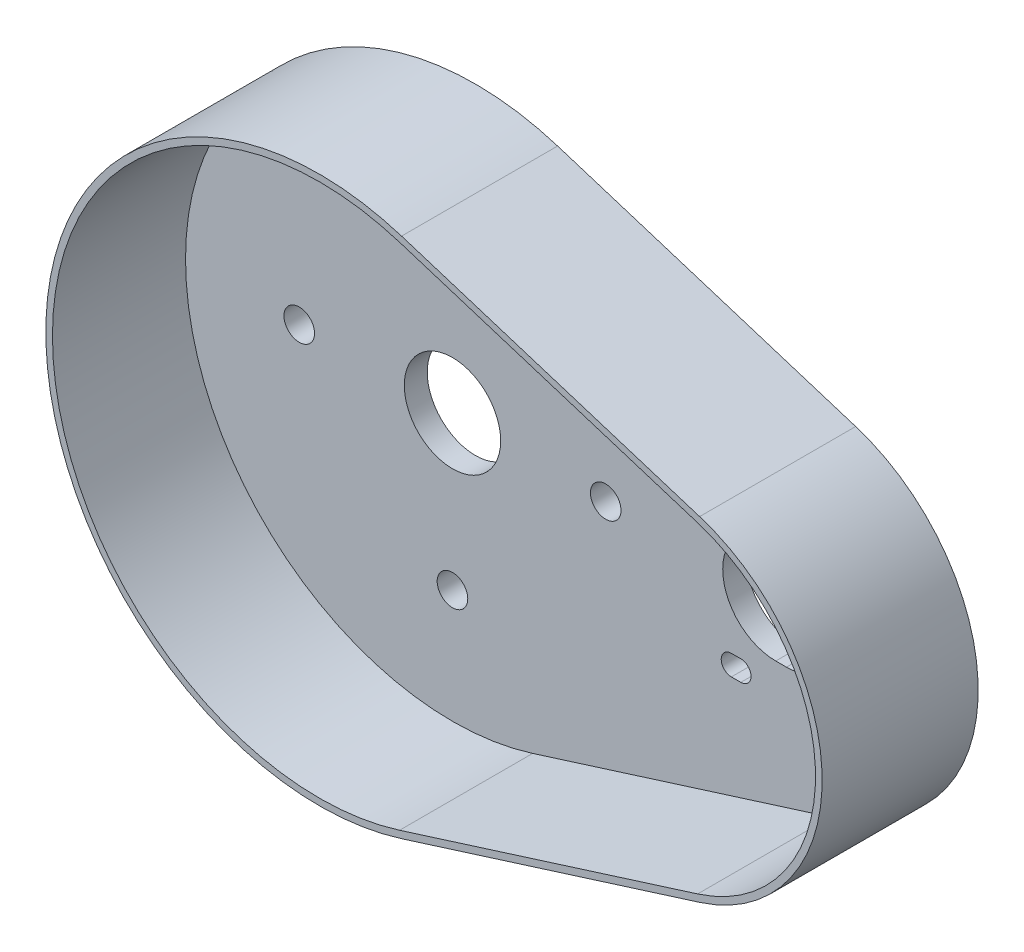
ISO-10303-21;
HEADER;
FILE_DESCRIPTION(('STEP AP214'),'2;1');
FILE_NAME('part.step','',(''),(''),'','','');
FILE_SCHEMA(('AUTOMOTIVE_DESIGN { 1 0 10303 214 1 1 1 1 }'));
ENDSEC;
DATA;
#1=APPLICATION_CONTEXT('core data for automotive mechanical design processes');
#2=APPLICATION_PROTOCOL_DEFINITION('international standard','automotive_design',2000,#1);
#3=PRODUCT_CONTEXT('',#1,'mechanical');
#4=PRODUCT('Part','Part','',(#3));
#5=PRODUCT_RELATED_PRODUCT_CATEGORY('part','',(#4));
#6=PRODUCT_DEFINITION_FORMATION('','',#4);
#7=PRODUCT_DEFINITION_CONTEXT('part definition',#1,'design');
#8=PRODUCT_DEFINITION('design','',#6,#7);
#9=PRODUCT_DEFINITION_SHAPE('','',#8);
#10=(LENGTH_UNIT() NAMED_UNIT(*) SI_UNIT(.MILLI.,.METRE.));
#11=(NAMED_UNIT(*) PLANE_ANGLE_UNIT() SI_UNIT($,.RADIAN.));
#12=(NAMED_UNIT(*) SI_UNIT($,.STERADIAN.) SOLID_ANGLE_UNIT());
#13=UNCERTAINTY_MEASURE_WITH_UNIT(LENGTH_MEASURE(1.E-05),#10,'distance_accuracy_value','');
#14=(GEOMETRIC_REPRESENTATION_CONTEXT(3) GLOBAL_UNCERTAINTY_ASSIGNED_CONTEXT((#13)) GLOBAL_UNIT_ASSIGNED_CONTEXT((#10,
#11,#12)) REPRESENTATION_CONTEXT('',''));
#15=CARTESIAN_POINT('',(0.,0.,0.));
#16=DIRECTION('',(0.,0.,1.));
#17=DIRECTION('',(1.,0.,0.));
#18=AXIS2_PLACEMENT_3D('',#15,#16,#17);
#19=CARTESIAN_POINT('',(0.,-13.4500000000001,30.6));
#20=DIRECTION('',(0.,1.,0.));
#21=DIRECTION('',(-1.,0.,0.));
#22=AXIS2_PLACEMENT_3D('',#19,#20,#21);
#23=PLANE('',#22);
#24=DIRECTION('',(1.,0.,0.));
#25=VECTOR('',#24,1.);
#26=CARTESIAN_POINT('',(0.,-13.4500000000001,4.5));
#27=LINE('',#26,#25);
#28=CARTESIAN_POINT('',(54.7010949780275,-13.45,4.5));
#29=VERTEX_POINT('',#28);
#30=CARTESIAN_POINT('',(56.5510949780275,-13.45,4.5));
#31=VERTEX_POINT('',#30);
#32=EDGE_CURVE('E270',#29,#31,#27,.T.);
#33=ORIENTED_EDGE('',*,*,#32,.F.);
#34=DIRECTION('',(0.,0.,-1.));
#35=VECTOR('',#34,1.);
#36=CARTESIAN_POINT('',(54.7010949780275,-13.45,30.6));
#37=LINE('',#36,#35);
#38=CARTESIAN_POINT('',(54.7010949780275,-13.45,0.));
#39=VERTEX_POINT('',#38);
#40=EDGE_CURVE('E422',#29,#39,#37,.T.);
#41=ORIENTED_EDGE('',*,*,#40,.T.);
#42=DIRECTION('',(1.,0.,0.));
#43=VECTOR('',#42,1.);
#44=CARTESIAN_POINT('',(0.,-13.4500000000001,0.));
#45=LINE('',#44,#43);
#46=CARTESIAN_POINT('',(56.5510949780275,-13.45,0.));
#47=VERTEX_POINT('',#46);
#48=EDGE_CURVE('E411',#39,#47,#45,.T.);
#49=ORIENTED_EDGE('',*,*,#48,.T.);
#50=DIRECTION('',(0.,0.,-1.));
#51=VECTOR('',#50,1.);
#52=CARTESIAN_POINT('',(56.5510949780275,-13.45,30.6));
#53=LINE('',#52,#51);
#54=EDGE_CURVE('E46',#31,#47,#53,.T.);
#55=ORIENTED_EDGE('',*,*,#54,.F.);
#56=EDGE_LOOP('',(#33,#41,#49,#55));
#57=FACE_BOUND('',#56,.T.);
#58=ADVANCED_FACE('F38',(#57),#23,.F.);
#59=CARTESIAN_POINT('',(56.5510949780275,-15.45,30.6));
#60=DIRECTION('',(0.,0.,-1.));
#61=DIRECTION('',(-1.,0.,0.));
#62=AXIS2_PLACEMENT_3D('',#59,#60,#61);
#63=CYLINDRICAL_SURFACE('',#62,2.);
#64=CARTESIAN_POINT('',(56.5510949780275,-15.45,4.5));
#65=DIRECTION('',(0.,0.,1.));
#66=DIRECTION('',(1.,0.,0.));
#67=AXIS2_PLACEMENT_3D('',#64,#65,#66);
#68=CIRCLE('',#67,2.);
#69=CARTESIAN_POINT('',(56.5510949780275,-17.45,4.5));
#70=VERTEX_POINT('',#69);
#71=EDGE_CURVE('E268',#31,#70,#68,.F.);
#72=ORIENTED_EDGE('',*,*,#71,.F.);
#73=ORIENTED_EDGE('',*,*,#54,.T.);
#74=CARTESIAN_POINT('',(56.5510949780275,-15.45,0.));
#75=DIRECTION('',(0.,0.,1.));
#76=DIRECTION('',(1.,0.,0.));
#77=AXIS2_PLACEMENT_3D('',#74,#75,#76);
#78=CIRCLE('',#77,2.);
#79=CARTESIAN_POINT('',(56.5510949780275,-17.45,0.));
#80=VERTEX_POINT('',#79);
#81=EDGE_CURVE('E414',#47,#80,#78,.F.);
#82=ORIENTED_EDGE('',*,*,#81,.T.);
#83=DIRECTION('',(0.,0.,-1.));
#84=VECTOR('',#83,1.);
#85=CARTESIAN_POINT('',(56.5510949780275,-17.45,30.6));
#86=LINE('',#85,#84);
#87=EDGE_CURVE('E427',#70,#80,#86,.T.);
#88=ORIENTED_EDGE('',*,*,#87,.F.);
#89=EDGE_LOOP('',(#72,#73,#82,#88));
#90=FACE_BOUND('',#89,.T.);
#91=ADVANCED_FACE('F500',(#90),#63,.F.);
#92=CARTESIAN_POINT('',(0.,-17.4499999999999,30.6));
#93=DIRECTION('',(0.,1.,0.));
#94=DIRECTION('',(-1.,0.,0.));
#95=AXIS2_PLACEMENT_3D('',#92,#93,#94);
#96=PLANE('',#95);
#97=DIRECTION('',(0.,0.,-1.));
#98=VECTOR('',#97,1.);
#99=CARTESIAN_POINT('',(54.7010949780275,-17.45,30.6));
#100=LINE('',#99,#98);
#101=CARTESIAN_POINT('',(54.7010949780275,-17.45,4.5));
#102=VERTEX_POINT('',#101);
#103=CARTESIAN_POINT('',(54.7010949780275,-17.45,0.));
#104=VERTEX_POINT('',#103);
#105=EDGE_CURVE('E424',#102,#104,#100,.T.);
#106=ORIENTED_EDGE('',*,*,#105,.F.);
#107=DIRECTION('',(1.,0.,0.));
#108=VECTOR('',#107,1.);
#109=CARTESIAN_POINT('',(0.,-17.4499999999999,4.5));
#110=LINE('',#109,#108);
#111=EDGE_CURVE('E262',#102,#70,#110,.T.);
#112=ORIENTED_EDGE('',*,*,#111,.T.);
#113=ORIENTED_EDGE('',*,*,#87,.T.);
#114=DIRECTION('',(1.,0.,0.));
#115=VECTOR('',#114,1.);
#116=CARTESIAN_POINT('',(0.,-17.4499999999999,0.));
#117=LINE('',#116,#115);
#118=EDGE_CURVE('E417',#104,#80,#117,.T.);
#119=ORIENTED_EDGE('',*,*,#118,.F.);
#120=EDGE_LOOP('',(#106,#112,#113,#119));
#121=FACE_BOUND('',#120,.T.);
#122=ADVANCED_FACE('F506',(#121),#96,.T.);
#123=CARTESIAN_POINT('',(0.,-13.45,30.6));
#124=DIRECTION('',(0.,1.,0.));
#125=DIRECTION('',(0.,0.,1.));
#126=AXIS2_PLACEMENT_3D('',#123,#124,#125);
#127=PLANE('',#126);
#128=DIRECTION('',(1.,0.,0.));
#129=VECTOR('',#128,1.);
#130=CARTESIAN_POINT('',(0.,-13.45,4.5));
#131=LINE('',#130,#129);
#132=CARTESIAN_POINT('',(85.7510949780275,-13.45,4.5));
#133=VERTEX_POINT('',#132);
#134=CARTESIAN_POINT('',(87.6010949780275,-13.45,4.5));
#135=VERTEX_POINT('',#134);
#136=EDGE_CURVE('E323',#133,#135,#131,.T.);
#137=ORIENTED_EDGE('',*,*,#136,.F.);
#138=DIRECTION('',(0.,0.,-1.));
#139=VECTOR('',#138,1.);
#140=CARTESIAN_POINT('',(85.7510949780275,-13.45,30.6));
#141=LINE('',#140,#139);
#142=CARTESIAN_POINT('',(85.7510949780275,-13.45,0.));
#143=VERTEX_POINT('',#142);
#144=EDGE_CURVE('E430',#133,#143,#141,.T.);
#145=ORIENTED_EDGE('',*,*,#144,.T.);
#146=DIRECTION('',(1.,0.,0.));
#147=VECTOR('',#146,1.);
#148=CARTESIAN_POINT('',(0.,-13.45,0.));
#149=LINE('',#148,#147);
#150=CARTESIAN_POINT('',(87.6010949780275,-13.45,0.));
#151=VERTEX_POINT('',#150);
#152=EDGE_CURVE('E399',#143,#151,#149,.T.);
#153=ORIENTED_EDGE('',*,*,#152,.T.);
#154=DIRECTION('',(0.,0.,-1.));
#155=VECTOR('',#154,1.);
#156=CARTESIAN_POINT('',(87.6010949780275,-13.45,30.6));
#157=LINE('',#156,#155);
#158=EDGE_CURVE('E425',#135,#151,#157,.T.);
#159=ORIENTED_EDGE('',*,*,#158,.F.);
#160=EDGE_LOOP('',(#137,#145,#153,#159));
#161=FACE_BOUND('',#160,.T.);
#162=ADVANCED_FACE('F526',(#161),#127,.F.);
#163=CARTESIAN_POINT('',(87.6010949780275,-15.45,30.6));
#164=DIRECTION('',(0.,0.,-1.));
#165=DIRECTION('',(-1.,0.,0.));
#166=AXIS2_PLACEMENT_3D('',#163,#164,#165);
#167=CYLINDRICAL_SURFACE('',#166,2.);
#168=CARTESIAN_POINT('',(87.6010949780275,-15.45,4.5));
#169=DIRECTION('',(0.,0.,1.));
#170=DIRECTION('',(1.,0.,0.));
#171=AXIS2_PLACEMENT_3D('',#168,#169,#170);
#172=CIRCLE('',#171,2.);
#173=CARTESIAN_POINT('',(87.6010949780275,-17.45,4.5));
#174=VERTEX_POINT('',#173);
#175=EDGE_CURVE('E321',#135,#174,#172,.F.);
#176=ORIENTED_EDGE('',*,*,#175,.F.);
#177=ORIENTED_EDGE('',*,*,#158,.T.);
#178=CARTESIAN_POINT('',(87.6010949780275,-15.45,0.));
#179=DIRECTION('',(0.,0.,1.));
#180=DIRECTION('',(1.,0.,0.));
#181=AXIS2_PLACEMENT_3D('',#178,#179,#180);
#182=CIRCLE('',#181,2.);
#183=CARTESIAN_POINT('',(87.6010949780275,-17.45,0.));
#184=VERTEX_POINT('',#183);
#185=EDGE_CURVE('E402',#151,#184,#182,.F.);
#186=ORIENTED_EDGE('',*,*,#185,.T.);
#187=DIRECTION('',(0.,0.,-1.));
#188=VECTOR('',#187,1.);
#189=CARTESIAN_POINT('',(87.6010949780275,-17.45,30.6));
#190=LINE('',#189,#188);
#191=EDGE_CURVE('E435',#174,#184,#190,.T.);
#192=ORIENTED_EDGE('',*,*,#191,.F.);
#193=EDGE_LOOP('',(#176,#177,#186,#192));
#194=FACE_BOUND('',#193,.T.);
#195=ADVANCED_FACE('F522',(#194),#167,.F.);
#196=CARTESIAN_POINT('',(0.,-17.45,30.6));
#197=DIRECTION('',(0.,1.,0.));
#198=DIRECTION('',(0.,0.,1.));
#199=AXIS2_PLACEMENT_3D('',#196,#197,#198);
#200=PLANE('',#199);
#201=DIRECTION('',(0.,0.,-1.));
#202=VECTOR('',#201,1.);
#203=CARTESIAN_POINT('',(85.7510949780275,-17.45,30.6));
#204=LINE('',#203,#202);
#205=CARTESIAN_POINT('',(85.7510949780275,-17.45,4.5));
#206=VERTEX_POINT('',#205);
#207=CARTESIAN_POINT('',(85.7510949780275,-17.45,0.));
#208=VERTEX_POINT('',#207);
#209=EDGE_CURVE('E432',#206,#208,#204,.T.);
#210=ORIENTED_EDGE('',*,*,#209,.F.);
#211=DIRECTION('',(1.,0.,0.));
#212=VECTOR('',#211,1.);
#213=CARTESIAN_POINT('',(0.,-17.45,4.5));
#214=LINE('',#213,#212);
#215=EDGE_CURVE('E53',#206,#174,#214,.T.);
#216=ORIENTED_EDGE('',*,*,#215,.T.);
#217=ORIENTED_EDGE('',*,*,#191,.T.);
#218=DIRECTION('',(1.,0.,0.));
#219=VECTOR('',#218,1.);
#220=CARTESIAN_POINT('',(0.,-17.45,0.));
#221=LINE('',#220,#219);
#222=EDGE_CURVE('E405',#208,#184,#221,.T.);
#223=ORIENTED_EDGE('',*,*,#222,.F.);
#224=EDGE_LOOP('',(#210,#216,#217,#223));
#225=FACE_BOUND('',#224,.T.);
#226=ADVANCED_FACE('F518',(#225),#200,.T.);
#227=CARTESIAN_POINT('',(87.6010949780275,15.45,30.6));
#228=DIRECTION('',(0.,0.,-1.));
#229=DIRECTION('',(-1.,0.,0.));
#230=AXIS2_PLACEMENT_3D('',#227,#228,#229);
#231=CYLINDRICAL_SURFACE('',#230,2.);
#232=DIRECTION('',(0.,0.,-1.));
#233=VECTOR('',#232,1.);
#234=CARTESIAN_POINT('',(87.6010949780275,13.45,30.6));
#235=LINE('',#234,#233);
#236=CARTESIAN_POINT('',(87.6010949780275,13.45,4.5));
#237=VERTEX_POINT('',#236);
#238=CARTESIAN_POINT('',(87.6010949780275,13.45,0.));
#239=VERTEX_POINT('',#238);
#240=EDGE_CURVE('E433',#237,#239,#235,.T.);
#241=ORIENTED_EDGE('',*,*,#240,.F.);
#242=CARTESIAN_POINT('',(87.6010949780275,15.45,4.5));
#243=DIRECTION('',(0.,0.,1.));
#244=DIRECTION('',(1.,0.,0.));
#245=AXIS2_PLACEMENT_3D('',#242,#243,#244);
#246=CIRCLE('',#245,2.);
#247=CARTESIAN_POINT('',(87.6010949780275,17.45,4.5));
#248=VERTEX_POINT('',#247);
#249=EDGE_CURVE('E315',#237,#248,#246,.T.);
#250=ORIENTED_EDGE('',*,*,#249,.T.);
#251=DIRECTION('',(0.,0.,-1.));
#252=VECTOR('',#251,1.);
#253=CARTESIAN_POINT('',(87.6010949780275,17.45,30.6));
#254=LINE('',#253,#252);
#255=CARTESIAN_POINT('',(87.6010949780275,17.45,0.));
#256=VERTEX_POINT('',#255);
#257=EDGE_CURVE('E438',#248,#256,#254,.T.);
#258=ORIENTED_EDGE('',*,*,#257,.T.);
#259=CARTESIAN_POINT('',(87.6010949780275,15.45,0.));
#260=DIRECTION('',(0.,0.,1.));
#261=DIRECTION('',(1.,0.,0.));
#262=AXIS2_PLACEMENT_3D('',#259,#260,#261);
#263=CIRCLE('',#262,2.);
#264=EDGE_CURVE('E387',#239,#256,#263,.T.);
#265=ORIENTED_EDGE('',*,*,#264,.F.);
#266=EDGE_LOOP('',(#241,#250,#258,#265));
#267=FACE_BOUND('',#266,.T.);
#268=ADVANCED_FACE('F521',(#267),#231,.F.);
#269=CARTESIAN_POINT('',(0.,13.45,30.6));
#270=DIRECTION('',(0.,1.,0.));
#271=DIRECTION('',(0.,0.,1.));
#272=AXIS2_PLACEMENT_3D('',#269,#270,#271);
#273=PLANE('',#272);
#274=DIRECTION('',(0.,0.,-1.));
#275=VECTOR('',#274,1.);
#276=CARTESIAN_POINT('',(85.7510949780275,13.45,30.6));
#277=LINE('',#276,#275);
#278=CARTESIAN_POINT('',(85.7510949780275,13.45,4.5));
#279=VERTEX_POINT('',#278);
#280=CARTESIAN_POINT('',(85.7510949780275,13.45,0.));
#281=VERTEX_POINT('',#280);
#282=EDGE_CURVE('E443',#279,#281,#277,.T.);
#283=ORIENTED_EDGE('',*,*,#282,.F.);
#284=DIRECTION('',(1.,0.,0.));
#285=VECTOR('',#284,1.);
#286=CARTESIAN_POINT('',(0.,13.45,4.5));
#287=LINE('',#286,#285);
#288=EDGE_CURVE('E312',#279,#237,#287,.T.);
#289=ORIENTED_EDGE('',*,*,#288,.T.);
#290=ORIENTED_EDGE('',*,*,#240,.T.);
#291=DIRECTION('',(1.,0.,0.));
#292=VECTOR('',#291,1.);
#293=CARTESIAN_POINT('',(0.,13.45,0.));
#294=LINE('',#293,#292);
#295=EDGE_CURVE('E390',#281,#239,#294,.T.);
#296=ORIENTED_EDGE('',*,*,#295,.F.);
#297=EDGE_LOOP('',(#283,#289,#290,#296));
#298=FACE_BOUND('',#297,.T.);
#299=ADVANCED_FACE('F539',(#298),#273,.T.);
#300=CARTESIAN_POINT('',(85.7510949780275,15.45,30.6));
#301=DIRECTION('',(0.,0.,-1.));
#302=DIRECTION('',(-1.,0.,0.));
#303=AXIS2_PLACEMENT_3D('',#300,#301,#302);
#304=CYLINDRICAL_SURFACE('',#303,2.);
#305=DIRECTION('',(0.,0.,-1.));
#306=VECTOR('',#305,1.);
#307=CARTESIAN_POINT('',(85.7510949780275,17.45,30.6));
#308=LINE('',#307,#306);
#309=CARTESIAN_POINT('',(85.7510949780275,17.45,4.5));
#310=VERTEX_POINT('',#309);
#311=CARTESIAN_POINT('',(85.7510949780275,17.45,0.));
#312=VERTEX_POINT('',#311);
#313=EDGE_CURVE('E440',#310,#312,#308,.T.);
#314=ORIENTED_EDGE('',*,*,#313,.F.);
#315=CARTESIAN_POINT('',(85.7510949780275,15.45,4.5));
#316=DIRECTION('',(0.,0.,1.));
#317=DIRECTION('',(1.,0.,0.));
#318=AXIS2_PLACEMENT_3D('',#315,#316,#317);
#319=CIRCLE('',#318,2.);
#320=EDGE_CURVE('E61',#310,#279,#319,.T.);
#321=ORIENTED_EDGE('',*,*,#320,.T.);
#322=ORIENTED_EDGE('',*,*,#282,.T.);
#323=CARTESIAN_POINT('',(85.7510949780275,15.45,0.));
#324=DIRECTION('',(0.,0.,1.));
#325=DIRECTION('',(1.,0.,0.));
#326=AXIS2_PLACEMENT_3D('',#323,#324,#325);
#327=CIRCLE('',#326,2.);
#328=EDGE_CURVE('E393',#312,#281,#327,.T.);
#329=ORIENTED_EDGE('',*,*,#328,.F.);
#330=EDGE_LOOP('',(#314,#321,#322,#329));
#331=FACE_BOUND('',#330,.T.);
#332=ADVANCED_FACE('F535',(#331),#304,.F.);
#333=CARTESIAN_POINT('',(56.5510949780275,15.45,30.6));
#334=DIRECTION('',(0.,0.,-1.));
#335=DIRECTION('',(-1.,0.,0.));
#336=AXIS2_PLACEMENT_3D('',#333,#334,#335);
#337=CYLINDRICAL_SURFACE('',#336,2.);
#338=DIRECTION('',(0.,0.,-1.));
#339=VECTOR('',#338,1.);
#340=CARTESIAN_POINT('',(56.5510949780275,13.45,30.6));
#341=LINE('',#340,#339);
#342=CARTESIAN_POINT('',(56.5510949780275,13.45,4.5));
#343=VERTEX_POINT('',#342);
#344=CARTESIAN_POINT('',(56.5510949780275,13.45,0.));
#345=VERTEX_POINT('',#344);
#346=EDGE_CURVE('E441',#343,#345,#341,.T.);
#347=ORIENTED_EDGE('',*,*,#346,.F.);
#348=CARTESIAN_POINT('',(56.5510949780275,15.45,4.5));
#349=DIRECTION('',(0.,0.,1.));
#350=DIRECTION('',(1.,0.,0.));
#351=AXIS2_PLACEMENT_3D('',#348,#349,#350);
#352=CIRCLE('',#351,2.);
#353=CARTESIAN_POINT('',(56.5510949780275,17.45,4.5));
#354=VERTEX_POINT('',#353);
#355=EDGE_CURVE('E306',#343,#354,#352,.T.);
#356=ORIENTED_EDGE('',*,*,#355,.T.);
#357=DIRECTION('',(0.,0.,-1.));
#358=VECTOR('',#357,1.);
#359=CARTESIAN_POINT('',(56.5510949780275,17.45,30.6));
#360=LINE('',#359,#358);
#361=CARTESIAN_POINT('',(56.5510949780275,17.45,0.));
#362=VERTEX_POINT('',#361);
#363=EDGE_CURVE('E446',#354,#362,#360,.T.);
#364=ORIENTED_EDGE('',*,*,#363,.T.);
#365=CARTESIAN_POINT('',(56.5510949780275,15.45,0.));
#366=DIRECTION('',(0.,0.,1.));
#367=DIRECTION('',(1.,0.,0.));
#368=AXIS2_PLACEMENT_3D('',#365,#366,#367);
#369=CIRCLE('',#368,2.);
#370=EDGE_CURVE('E375',#345,#362,#369,.T.);
#371=ORIENTED_EDGE('',*,*,#370,.F.);
#372=EDGE_LOOP('',(#347,#356,#364,#371));
#373=FACE_BOUND('',#372,.T.);
#374=ADVANCED_FACE('F538',(#373),#337,.F.);
#375=CARTESIAN_POINT('',(0.,13.4500000000001,30.6));
#376=DIRECTION('',(0.,1.,0.));
#377=DIRECTION('',(-1.,0.,0.));
#378=AXIS2_PLACEMENT_3D('',#375,#376,#377);
#379=PLANE('',#378);
#380=DIRECTION('',(0.,0.,-1.));
#381=VECTOR('',#380,1.);
#382=CARTESIAN_POINT('',(54.7010949780275,13.45,30.6));
#383=LINE('',#382,#381);
#384=CARTESIAN_POINT('',(54.7010949780275,13.45,4.5));
#385=VERTEX_POINT('',#384);
#386=CARTESIAN_POINT('',(54.7010949780275,13.45,0.));
#387=VERTEX_POINT('',#386);
#388=EDGE_CURVE('E451',#385,#387,#383,.T.);
#389=ORIENTED_EDGE('',*,*,#388,.F.);
#390=DIRECTION('',(1.,0.,0.));
#391=VECTOR('',#390,1.);
#392=CARTESIAN_POINT('',(0.,13.4500000000001,4.5));
#393=LINE('',#392,#391);
#394=EDGE_CURVE('E303',#385,#343,#393,.T.);
#395=ORIENTED_EDGE('',*,*,#394,.T.);
#396=ORIENTED_EDGE('',*,*,#346,.T.);
#397=DIRECTION('',(1.,0.,0.));
#398=VECTOR('',#397,1.);
#399=CARTESIAN_POINT('',(0.,13.4500000000001,0.));
#400=LINE('',#399,#398);
#401=EDGE_CURVE('E378',#387,#345,#400,.T.);
#402=ORIENTED_EDGE('',*,*,#401,.F.);
#403=EDGE_LOOP('',(#389,#395,#396,#402));
#404=FACE_BOUND('',#403,.T.);
#405=ADVANCED_FACE('F555',(#404),#379,.T.);
#406=CARTESIAN_POINT('',(54.7010949780275,15.45,30.6));
#407=DIRECTION('',(0.,0.,-1.));
#408=DIRECTION('',(-1.,0.,0.));
#409=AXIS2_PLACEMENT_3D('',#406,#407,#408);
#410=CYLINDRICAL_SURFACE('',#409,2.);
#411=DIRECTION('',(0.,0.,-1.));
#412=VECTOR('',#411,1.);
#413=CARTESIAN_POINT('',(54.7010949780275,17.45,30.6));
#414=LINE('',#413,#412);
#415=CARTESIAN_POINT('',(54.7010949780275,17.45,4.5));
#416=VERTEX_POINT('',#415);
#417=CARTESIAN_POINT('',(54.7010949780275,17.45,0.));
#418=VERTEX_POINT('',#417);
#419=EDGE_CURVE('E448',#416,#418,#414,.T.);
#420=ORIENTED_EDGE('',*,*,#419,.F.);
#421=CARTESIAN_POINT('',(54.7010949780275,15.45,4.5));
#422=DIRECTION('',(0.,0.,1.));
#423=DIRECTION('',(1.,0.,0.));
#424=AXIS2_PLACEMENT_3D('',#421,#422,#423);
#425=CIRCLE('',#424,2.);
#426=EDGE_CURVE('E300',#416,#385,#425,.T.);
#427=ORIENTED_EDGE('',*,*,#426,.T.);
#428=ORIENTED_EDGE('',*,*,#388,.T.);
#429=CARTESIAN_POINT('',(54.7010949780275,15.45,0.));
#430=DIRECTION('',(0.,0.,1.));
#431=DIRECTION('',(1.,0.,0.));
#432=AXIS2_PLACEMENT_3D('',#429,#430,#431);
#433=CIRCLE('',#432,2.);
#434=EDGE_CURVE('E381',#418,#387,#433,.T.);
#435=ORIENTED_EDGE('',*,*,#434,.F.);
#436=EDGE_LOOP('',(#420,#427,#428,#435));
#437=FACE_BOUND('',#436,.T.);
#438=ADVANCED_FACE('F551',(#437),#410,.F.);
#439=CARTESIAN_POINT('',(63.4,0.,30.6));
#440=DIRECTION('',(0.,0.,-1.));
#441=DIRECTION('',(-1.,0.,0.));
#442=AXIS2_PLACEMENT_3D('',#439,#440,#441);
#443=CYLINDRICAL_SURFACE('',#442,10.4);
#444=DIRECTION('',(0.,0.,-1.));
#445=VECTOR('',#444,1.);
#446=CARTESIAN_POINT('',(63.4,10.4,30.6));
#447=LINE('',#446,#445);
#448=CARTESIAN_POINT('',(63.4,10.4,4.5));
#449=VERTEX_POINT('',#448);
#450=CARTESIAN_POINT('',(63.4,10.4,0.));
#451=VERTEX_POINT('',#450);
#452=EDGE_CURVE('E449',#449,#451,#447,.T.);
#453=ORIENTED_EDGE('',*,*,#452,.F.);
#454=CARTESIAN_POINT('',(63.4,0.,4.5));
#455=DIRECTION('',(0.,0.,1.));
#456=DIRECTION('',(1.,0.,0.));
#457=AXIS2_PLACEMENT_3D('',#454,#455,#456);
#458=CIRCLE('',#457,10.4);
#459=CARTESIAN_POINT('',(63.4,-10.4,4.5));
#460=VERTEX_POINT('',#459);
#461=EDGE_CURVE('E283',#449,#460,#458,.T.);
#462=ORIENTED_EDGE('',*,*,#461,.T.);
#463=DIRECTION('',(0.,0.,-1.));
#464=VECTOR('',#463,1.);
#465=CARTESIAN_POINT('',(63.4,-10.4,30.6));
#466=LINE('',#465,#464);
#467=CARTESIAN_POINT('',(63.4,-10.4,0.));
#468=VERTEX_POINT('',#467);
#469=EDGE_CURVE('E454',#460,#468,#466,.T.);
#470=ORIENTED_EDGE('',*,*,#469,.T.);
#471=CARTESIAN_POINT('',(63.4,0.,0.));
#472=DIRECTION('',(0.,0.,1.));
#473=DIRECTION('',(1.,0.,0.));
#474=AXIS2_PLACEMENT_3D('',#471,#472,#473);
#475=CIRCLE('',#474,10.4);
#476=EDGE_CURVE('E351',#451,#468,#475,.T.);
#477=ORIENTED_EDGE('',*,*,#476,.F.);
#478=EDGE_LOOP('',(#453,#462,#470,#477));
#479=FACE_BOUND('',#478,.T.);
#480=ADVANCED_FACE('F554',(#479),#443,.F.);
#481=CARTESIAN_POINT('',(0.,10.4,30.6));
#482=DIRECTION('',(0.,1.,0.));
#483=DIRECTION('',(0.,0.,1.));
#484=AXIS2_PLACEMENT_3D('',#481,#482,#483);
#485=PLANE('',#484);
#486=DIRECTION('',(1.,0.,0.));
#487=VECTOR('',#486,1.);
#488=CARTESIAN_POINT('',(0.,10.4,4.5));
#489=LINE('',#488,#487);
#490=CARTESIAN_POINT('',(65.5,10.4,4.5));
#491=VERTEX_POINT('',#490);
#492=EDGE_CURVE('E281',#449,#491,#489,.T.);
#493=ORIENTED_EDGE('',*,*,#492,.F.);
#494=ORIENTED_EDGE('',*,*,#452,.T.);
#495=DIRECTION('',(1.,0.,0.));
#496=VECTOR('',#495,1.);
#497=CARTESIAN_POINT('',(0.,10.4,0.));
#498=LINE('',#497,#496);
#499=CARTESIAN_POINT('',(65.5,10.4,0.));
#500=VERTEX_POINT('',#499);
#501=EDGE_CURVE('E354',#451,#500,#498,.T.);
#502=ORIENTED_EDGE('',*,*,#501,.T.);
#503=DIRECTION('',(0.,0.,-1.));
#504=VECTOR('',#503,1.);
#505=CARTESIAN_POINT('',(65.5,10.4,30.6));
#506=LINE('',#505,#504);
#507=EDGE_CURVE('E459',#491,#500,#506,.T.);
#508=ORIENTED_EDGE('',*,*,#507,.F.);
#509=EDGE_LOOP('',(#493,#494,#502,#508));
#510=FACE_BOUND('',#509,.T.);
#511=ADVANCED_FACE('F585',(#510),#485,.F.);
#512=CARTESIAN_POINT('',(65.5,0.,30.6));
#513=DIRECTION('',(0.,0.,-1.));
#514=DIRECTION('',(-1.,0.,0.));
#515=AXIS2_PLACEMENT_3D('',#512,#513,#514);
#516=CYLINDRICAL_SURFACE('',#515,10.4);
#517=DIRECTION('',(0.,0.,-1.));
#518=VECTOR('',#517,1.);
#519=CARTESIAN_POINT('',(65.5,-10.4,30.6));
#520=LINE('',#519,#518);
#521=CARTESIAN_POINT('',(65.5,-10.4,4.5));
#522=VERTEX_POINT('',#521);
#523=CARTESIAN_POINT('',(65.5,-10.4,0.));
#524=VERTEX_POINT('',#523);
#525=EDGE_CURVE('E456',#522,#524,#520,.T.);
#526=ORIENTED_EDGE('',*,*,#525,.F.);
#527=CARTESIAN_POINT('',(65.5,0.,4.5));
#528=DIRECTION('',(0.,0.,1.));
#529=DIRECTION('',(1.,0.,0.));
#530=AXIS2_PLACEMENT_3D('',#527,#528,#529);
#531=CIRCLE('',#530,10.4);
#532=EDGE_CURVE('E278',#522,#491,#531,.T.);
#533=ORIENTED_EDGE('',*,*,#532,.T.);
#534=ORIENTED_EDGE('',*,*,#507,.T.);
#535=CARTESIAN_POINT('',(65.5,0.,0.));
#536=DIRECTION('',(0.,0.,1.));
#537=DIRECTION('',(1.,0.,0.));
#538=AXIS2_PLACEMENT_3D('',#535,#536,#537);
#539=CIRCLE('',#538,10.4);
#540=EDGE_CURVE('E357',#524,#500,#539,.T.);
#541=ORIENTED_EDGE('',*,*,#540,.F.);
#542=EDGE_LOOP('',(#526,#533,#534,#541));
#543=FACE_BOUND('',#542,.T.);
#544=ADVANCED_FACE('F516',(#543),#516,.F.);
#545=CARTESIAN_POINT('',(85.7510949780275,-15.45,30.6));
#546=DIRECTION('',(0.,0.,-1.));
#547=DIRECTION('',(-1.,0.,0.));
#548=AXIS2_PLACEMENT_3D('',#545,#546,#547);
#549=CYLINDRICAL_SURFACE('',#548,2.);
#550=CARTESIAN_POINT('',(85.7510949780275,-15.45,4.5));
#551=DIRECTION('',(0.,0.,1.));
#552=DIRECTION('',(1.,0.,0.));
#553=AXIS2_PLACEMENT_3D('',#550,#551,#552);
#554=CIRCLE('',#553,2.);
#555=EDGE_CURVE('E318',#206,#133,#554,.F.);
#556=ORIENTED_EDGE('',*,*,#555,.F.);
#557=ORIENTED_EDGE('',*,*,#209,.T.);
#558=CARTESIAN_POINT('',(85.7510949780275,-15.45,0.));
#559=DIRECTION('',(0.,0.,1.));
#560=DIRECTION('',(1.,0.,0.));
#561=AXIS2_PLACEMENT_3D('',#558,#559,#560);
#562=CIRCLE('',#561,2.);
#563=EDGE_CURVE('E408',#208,#143,#562,.F.);
#564=ORIENTED_EDGE('',*,*,#563,.T.);
#565=ORIENTED_EDGE('',*,*,#144,.F.);
#566=EDGE_LOOP('',(#556,#557,#564,#565));
#567=FACE_BOUND('',#566,.T.);
#568=ADVANCED_FACE('F512',(#567),#549,.F.);
#569=CARTESIAN_POINT('',(0.,17.45,30.6));
#570=DIRECTION('',(0.,1.,0.));
#571=DIRECTION('',(0.,0.,1.));
#572=AXIS2_PLACEMENT_3D('',#569,#570,#571);
#573=PLANE('',#572);
#574=DIRECTION('',(1.,0.,0.));
#575=VECTOR('',#574,1.);
#576=CARTESIAN_POINT('',(0.,17.45,4.5));
#577=LINE('',#576,#575);
#578=EDGE_CURVE('E309',#310,#248,#577,.T.);
#579=ORIENTED_EDGE('',*,*,#578,.F.);
#580=ORIENTED_EDGE('',*,*,#313,.T.);
#581=DIRECTION('',(1.,0.,0.));
#582=VECTOR('',#581,1.);
#583=CARTESIAN_POINT('',(0.,17.45,0.));
#584=LINE('',#583,#582);
#585=EDGE_CURVE('E396',#312,#256,#584,.T.);
#586=ORIENTED_EDGE('',*,*,#585,.T.);
#587=ORIENTED_EDGE('',*,*,#257,.F.);
#588=EDGE_LOOP('',(#579,#580,#586,#587));
#589=FACE_BOUND('',#588,.T.);
#590=ADVANCED_FACE('F515',(#589),#573,.F.);
#591=CARTESIAN_POINT('',(0.,17.4499999999999,30.6));
#592=DIRECTION('',(0.,1.,0.));
#593=DIRECTION('',(-1.,0.,0.));
#594=AXIS2_PLACEMENT_3D('',#591,#592,#593);
#595=PLANE('',#594);
#596=DIRECTION('',(1.,0.,0.));
#597=VECTOR('',#596,1.);
#598=CARTESIAN_POINT('',(0.,17.4499999999999,4.5));
#599=LINE('',#598,#597);
#600=EDGE_CURVE('E298',#416,#354,#599,.T.);
#601=ORIENTED_EDGE('',*,*,#600,.F.);
#602=ORIENTED_EDGE('',*,*,#419,.T.);
#603=DIRECTION('',(1.,0.,0.));
#604=VECTOR('',#603,1.);
#605=CARTESIAN_POINT('',(0.,17.4499999999999,0.));
#606=LINE('',#605,#604);
#607=EDGE_CURVE('E384',#418,#362,#606,.T.);
#608=ORIENTED_EDGE('',*,*,#607,.T.);
#609=ORIENTED_EDGE('',*,*,#363,.F.);
#610=EDGE_LOOP('',(#601,#602,#608,#609));
#611=FACE_BOUND('',#610,.T.);
#612=ADVANCED_FACE('F533',(#611),#595,.F.);
#613=CARTESIAN_POINT('',(0.,0.,30.6));
#614=DIRECTION('',(0.,0.,-1.));
#615=DIRECTION('',(-1.,0.,0.));
#616=AXIS2_PLACEMENT_3D('',#613,#614,#615);
#617=CYLINDRICAL_SURFACE('',#616,9.45);
#618=CARTESIAN_POINT('',(0.,0.,0.));
#619=DIRECTION('',(0.,0.,1.));
#620=DIRECTION('',(1.,0.,0.));
#621=AXIS2_PLACEMENT_3D('',#618,#619,#620);
#622=CIRCLE('',#621,9.45);
#623=CARTESIAN_POINT('',(9.45,0.,0.));
#624=VERTEX_POINT('',#623);
#625=EDGE_CURVE('E372',#624,#624,#622,.T.);
#626=ORIENTED_EDGE('',*,*,#625,.F.);
#627=EDGE_LOOP('',(#626));
#628=FACE_BOUND('',#627,.T.);
#629=CARTESIAN_POINT('',(0.,0.,4.5));
#630=DIRECTION('',(0.,0.,1.));
#631=DIRECTION('',(1.,0.,0.));
#632=AXIS2_PLACEMENT_3D('',#629,#630,#631);
#633=CIRCLE('',#632,9.45);
#634=CARTESIAN_POINT('',(9.45,0.,4.5));
#635=VERTEX_POINT('',#634);
#636=EDGE_CURVE('E295',#635,#635,#633,.T.);
#637=ORIENTED_EDGE('',*,*,#636,.T.);
#638=EDGE_LOOP('',(#637));
#639=FACE_BOUND('',#638,.T.);
#640=ADVANCED_FACE('F549',(#628,#639),#617,.F.);
#641=CARTESIAN_POINT('',(0.,30.05,30.6));
#642=DIRECTION('',(0.,0.,-1.));
#643=DIRECTION('',(-1.,0.,0.));
#644=AXIS2_PLACEMENT_3D('',#641,#642,#643);
#645=CYLINDRICAL_SURFACE('',#644,3.);
#646=CARTESIAN_POINT('',(0.,30.05,0.));
#647=DIRECTION('',(0.,0.,1.));
#648=DIRECTION('',(1.,0.,0.));
#649=AXIS2_PLACEMENT_3D('',#646,#647,#648);
#650=CIRCLE('',#649,3.);
#651=CARTESIAN_POINT('',(3.,30.05,0.));
#652=VERTEX_POINT('',#651);
#653=EDGE_CURVE('E369',#652,#652,#650,.T.);
#654=ORIENTED_EDGE('',*,*,#653,.F.);
#655=EDGE_LOOP('',(#654));
#656=FACE_BOUND('',#655,.T.);
#657=CARTESIAN_POINT('',(0.,30.05,4.5));
#658=DIRECTION('',(0.,0.,1.));
#659=DIRECTION('',(1.,0.,0.));
#660=AXIS2_PLACEMENT_3D('',#657,#658,#659);
#661=CIRCLE('',#660,3.);
#662=CARTESIAN_POINT('',(3.,30.05,4.5));
#663=VERTEX_POINT('',#662);
#664=EDGE_CURVE('E292',#663,#663,#661,.T.);
#665=ORIENTED_EDGE('',*,*,#664,.T.);
#666=EDGE_LOOP('',(#665));
#667=FACE_BOUND('',#666,.T.);
#668=ADVANCED_FACE('F565',(#656,#667),#645,.F.);
#669=CARTESIAN_POINT('',(0.,-30.05,30.6));
#670=DIRECTION('',(0.,0.,-1.));
#671=DIRECTION('',(-1.,0.,0.));
#672=AXIS2_PLACEMENT_3D('',#669,#670,#671);
#673=CYLINDRICAL_SURFACE('',#672,3.);
#674=CARTESIAN_POINT('',(0.,-30.05,0.));
#675=DIRECTION('',(0.,0.,1.));
#676=DIRECTION('',(1.,0.,0.));
#677=AXIS2_PLACEMENT_3D('',#674,#675,#676);
#678=CIRCLE('',#677,3.);
#679=CARTESIAN_POINT('',(3.,-30.05,0.));
#680=VERTEX_POINT('',#679);
#681=EDGE_CURVE('E366',#680,#680,#678,.T.);
#682=ORIENTED_EDGE('',*,*,#681,.F.);
#683=EDGE_LOOP('',(#682));
#684=FACE_BOUND('',#683,.T.);
#685=CARTESIAN_POINT('',(0.,-30.05,4.5));
#686=DIRECTION('',(0.,0.,1.));
#687=DIRECTION('',(1.,0.,0.));
#688=AXIS2_PLACEMENT_3D('',#685,#686,#687);
#689=CIRCLE('',#688,3.);
#690=CARTESIAN_POINT('',(3.,-30.05,4.5));
#691=VERTEX_POINT('',#690);
#692=EDGE_CURVE('E289',#691,#691,#689,.T.);
#693=ORIENTED_EDGE('',*,*,#692,.T.);
#694=EDGE_LOOP('',(#693));
#695=FACE_BOUND('',#694,.T.);
#696=ADVANCED_FACE('F569',(#684,#695),#673,.F.);
#697=CARTESIAN_POINT('',(-30.05,0.,30.6));
#698=DIRECTION('',(0.,0.,-1.));
#699=DIRECTION('',(-1.,0.,0.));
#700=AXIS2_PLACEMENT_3D('',#697,#698,#699);
#701=CYLINDRICAL_SURFACE('',#700,3.);
#702=CARTESIAN_POINT('',(-30.05,0.,0.));
#703=DIRECTION('',(0.,0.,1.));
#704=DIRECTION('',(1.,0.,0.));
#705=AXIS2_PLACEMENT_3D('',#702,#703,#704);
#706=CIRCLE('',#705,3.);
#707=CARTESIAN_POINT('',(-27.05,0.,0.));
#708=VERTEX_POINT('',#707);
#709=EDGE_CURVE('E363',#708,#708,#706,.T.);
#710=ORIENTED_EDGE('',*,*,#709,.F.);
#711=EDGE_LOOP('',(#710));
#712=FACE_BOUND('',#711,.T.);
#713=CARTESIAN_POINT('',(-30.05,0.,4.5));
#714=DIRECTION('',(0.,0.,1.));
#715=DIRECTION('',(1.,0.,0.));
#716=AXIS2_PLACEMENT_3D('',#713,#714,#715);
#717=CIRCLE('',#716,3.);
#718=CARTESIAN_POINT('',(-27.05,0.,4.5));
#719=VERTEX_POINT('',#718);
#720=EDGE_CURVE('E286',#719,#719,#717,.T.);
#721=ORIENTED_EDGE('',*,*,#720,.T.);
#722=EDGE_LOOP('',(#721));
#723=FACE_BOUND('',#722,.T.);
#724=ADVANCED_FACE('F573',(#712,#723),#701,.F.);
#725=CARTESIAN_POINT('',(0.,-10.4,30.6));
#726=DIRECTION('',(0.,1.,0.));
#727=DIRECTION('',(0.,0.,1.));
#728=AXIS2_PLACEMENT_3D('',#725,#726,#727);
#729=PLANE('',#728);
#730=ORIENTED_EDGE('',*,*,#469,.F.);
#731=DIRECTION('',(1.,0.,0.));
#732=VECTOR('',#731,1.);
#733=CARTESIAN_POINT('',(0.,-10.4,4.5));
#734=LINE('',#733,#732);
#735=EDGE_CURVE('E275',#460,#522,#734,.T.);
#736=ORIENTED_EDGE('',*,*,#735,.T.);
#737=ORIENTED_EDGE('',*,*,#525,.T.);
#738=DIRECTION('',(1.,0.,0.));
#739=VECTOR('',#738,1.);
#740=CARTESIAN_POINT('',(0.,-10.4,0.));
#741=LINE('',#740,#739);
#742=EDGE_CURVE('E360',#468,#524,#741,.T.);
#743=ORIENTED_EDGE('',*,*,#742,.F.);
#744=EDGE_LOOP('',(#730,#736,#737,#743));
#745=FACE_BOUND('',#744,.T.);
#746=ADVANCED_FACE('F577',(#745),#729,.T.);
#747=CARTESIAN_POINT('',(30.05,0.,30.6));
#748=DIRECTION('',(0.,0.,-1.));
#749=DIRECTION('',(-1.,0.,0.));
#750=AXIS2_PLACEMENT_3D('',#747,#748,#749);
#751=CYLINDRICAL_SURFACE('',#750,3.);
#752=CARTESIAN_POINT('',(30.05,0.,0.));
#753=DIRECTION('',(0.,0.,1.));
#754=DIRECTION('',(1.,0.,0.));
#755=AXIS2_PLACEMENT_3D('',#752,#753,#754);
#756=CIRCLE('',#755,3.);
#757=CARTESIAN_POINT('',(33.05,0.,0.));
#758=VERTEX_POINT('',#757);
#759=EDGE_CURVE('E348',#758,#758,#756,.T.);
#760=ORIENTED_EDGE('',*,*,#759,.F.);
#761=EDGE_LOOP('',(#760));
#762=FACE_BOUND('',#761,.T.);
#763=CARTESIAN_POINT('',(30.05,0.,4.5));
#764=DIRECTION('',(0.,0.,1.));
#765=DIRECTION('',(1.,0.,0.));
#766=AXIS2_PLACEMENT_3D('',#763,#764,#765);
#767=CIRCLE('',#766,3.);
#768=CARTESIAN_POINT('',(33.05,0.,4.5));
#769=VERTEX_POINT('',#768);
#770=EDGE_CURVE('E272',#769,#769,#767,.T.);
#771=ORIENTED_EDGE('',*,*,#770,.T.);
#772=EDGE_LOOP('',(#771));
#773=FACE_BOUND('',#772,.T.);
#774=ADVANCED_FACE('F581',(#762,#773),#751,.F.);
#775=CARTESIAN_POINT('',(54.7010949780275,-15.45,30.6));
#776=DIRECTION('',(0.,0.,-1.));
#777=DIRECTION('',(-1.,0.,0.));
#778=AXIS2_PLACEMENT_3D('',#775,#776,#777);
#779=CYLINDRICAL_SURFACE('',#778,2.);
#780=CARTESIAN_POINT('',(54.7010949780275,-15.45,4.5));
#781=DIRECTION('',(0.,0.,1.));
#782=DIRECTION('',(1.,0.,0.));
#783=AXIS2_PLACEMENT_3D('',#780,#781,#782);
#784=CIRCLE('',#783,2.);
#785=EDGE_CURVE('E11',#102,#29,#784,.F.);
#786=ORIENTED_EDGE('',*,*,#785,.F.);
#787=ORIENTED_EDGE('',*,*,#105,.T.);
#788=CARTESIAN_POINT('',(54.7010949780275,-15.45,0.));
#789=DIRECTION('',(0.,0.,1.));
#790=DIRECTION('',(1.,0.,0.));
#791=AXIS2_PLACEMENT_3D('',#788,#789,#790);
#792=CIRCLE('',#791,2.);
#793=EDGE_CURVE('E330',#104,#39,#792,.F.);
#794=ORIENTED_EDGE('',*,*,#793,.T.);
#795=ORIENTED_EDGE('',*,*,#40,.F.);
#796=EDGE_LOOP('',(#786,#787,#794,#795));
#797=FACE_BOUND('',#796,.T.);
#798=ADVANCED_FACE('F593',(#797),#779,.F.);
#799=CARTESIAN_POINT('',(16.1173747780786,-51.1717962383866,30.6));
#800=DIRECTION('',(-0.300417050849554,0.953807944797513,0.));
#801=DIRECTION('',(-0.953807944797513,-0.300417050849554,0.));
#802=AXIS2_PLACEMENT_3D('',#799,#800,#801);
#803=PLANE('',#802);
#804=DIRECTION('',(0.953807944797513,0.300417050849554,0.));
#805=VECTOR('',#804,1.);
#806=CARTESIAN_POINT('',(16.1173747780786,-51.1717962383866,0.));
#807=LINE('',#806,#805);
#808=CARTESIAN_POINT('',(16.1173747780786,-51.1717962383866,0.));
#809=VERTEX_POINT('',#808);
#810=CARTESIAN_POINT('',(74.571121213766,-32.7608549046521,0.));
#811=VERTEX_POINT('',#810);
#812=EDGE_CURVE('E325',#809,#811,#807,.T.);
#813=ORIENTED_EDGE('',*,*,#812,.T.);
#814=DIRECTION('',(0.,0.,-1.));
#815=VECTOR('',#814,1.);
#816=CARTESIAN_POINT('',(74.571121213766,-32.7608549046521,30.6));
#817=LINE('',#816,#815);
#818=CARTESIAN_POINT('',(74.571121213766,-32.7608549046521,30.6));
#819=VERTEX_POINT('',#818);
#820=EDGE_CURVE('E457',#819,#811,#817,.T.);
#821=ORIENTED_EDGE('',*,*,#820,.F.);
#822=DIRECTION('',(0.953807944797513,0.300417050849554,0.));
#823=VECTOR('',#822,1.);
#824=CARTESIAN_POINT('',(16.1173747780786,-51.1717962383866,30.6));
#825=LINE('',#824,#823);
#826=CARTESIAN_POINT('',(16.1173747780786,-51.1717962383866,30.6));
#827=VERTEX_POINT('',#826);
#828=EDGE_CURVE('E326',#827,#819,#825,.T.);
#829=ORIENTED_EDGE('',*,*,#828,.F.);
#830=DIRECTION('',(0.,0.,-1.));
#831=VECTOR('',#830,1.);
#832=CARTESIAN_POINT('',(16.1173747780786,-51.1717962383866,30.6));
#833=LINE('',#832,#831);
#834=EDGE_CURVE('E337',#827,#809,#833,.T.);
#835=ORIENTED_EDGE('',*,*,#834,.T.);
#836=EDGE_LOOP('',(#813,#821,#829,#835));
#837=FACE_BOUND('',#836,.T.);
#838=ADVANCED_FACE('F40',(#837),#803,.F.);
#839=CARTESIAN_POINT('',(64.2525665535245,0.,30.6));
#840=DIRECTION('',(0.,0.,-1.));
#841=DIRECTION('',(-1.,0.,0.));
#842=AXIS2_PLACEMENT_3D('',#839,#840,#841);
#843=CYLINDRICAL_SURFACE('',#842,34.3474334464755);
#844=CARTESIAN_POINT('',(64.2525665535245,0.,0.));
#845=DIRECTION('',(0.,0.,1.));
#846=DIRECTION('',(1.,0.,0.));
#847=AXIS2_PLACEMENT_3D('',#844,#845,#846);
#848=CIRCLE('',#847,34.3474334464755);
#849=CARTESIAN_POINT('',(74.571121213766,32.7608549046521,0.));
#850=VERTEX_POINT('',#849);
#851=EDGE_CURVE('E340',#811,#850,#848,.T.);
#852=ORIENTED_EDGE('',*,*,#851,.T.);
#853=DIRECTION('',(0.,0.,-1.));
#854=VECTOR('',#853,1.);
#855=CARTESIAN_POINT('',(74.571121213766,32.7608549046521,30.6));
#856=LINE('',#855,#854);
#857=CARTESIAN_POINT('',(74.571121213766,32.7608549046521,30.6));
#858=VERTEX_POINT('',#857);
#859=EDGE_CURVE('E466',#858,#850,#856,.T.);
#860=ORIENTED_EDGE('',*,*,#859,.F.);
#861=CARTESIAN_POINT('',(64.2525665535245,0.,30.6));
#862=DIRECTION('',(0.,0.,1.));
#863=DIRECTION('',(1.,0.,0.));
#864=AXIS2_PLACEMENT_3D('',#861,#862,#863);
#865=CIRCLE('',#864,34.3474334464755);
#866=EDGE_CURVE('E329',#819,#858,#865,.T.);
#867=ORIENTED_EDGE('',*,*,#866,.F.);
#868=ORIENTED_EDGE('',*,*,#820,.T.);
#869=EDGE_LOOP('',(#852,#860,#867,#868));
#870=FACE_BOUND('',#869,.T.);
#871=ADVANCED_FACE('F470',(#870),#843,.T.);
#872=CARTESIAN_POINT('',(16.1173747780786,51.1717962383866,30.6));
#873=DIRECTION('',(0.300417050849554,0.953807944797513,0.));
#874=DIRECTION('',(-0.953807944797513,0.300417050849554,0.));
#875=AXIS2_PLACEMENT_3D('',#872,#873,#874);
#876=PLANE('',#875);
#877=DIRECTION('',(0.953807944797513,-0.300417050849554,0.));
#878=VECTOR('',#877,1.);
#879=CARTESIAN_POINT('',(16.1173747780786,51.1717962383866,0.));
#880=LINE('',#879,#878);
#881=CARTESIAN_POINT('',(16.1173747780786,51.1717962383866,0.));
#882=VERTEX_POINT('',#881);
#883=EDGE_CURVE('E343',#882,#850,#880,.T.);
#884=ORIENTED_EDGE('',*,*,#883,.F.);
#885=DIRECTION('',(0.,0.,-1.));
#886=VECTOR('',#885,1.);
#887=CARTESIAN_POINT('',(16.1173747780786,51.1717962383866,30.6));
#888=LINE('',#887,#886);
#889=CARTESIAN_POINT('',(16.1173747780786,51.1717962383866,30.6));
#890=VERTEX_POINT('',#889);
#891=EDGE_CURVE('E464',#890,#882,#888,.T.);
#892=ORIENTED_EDGE('',*,*,#891,.F.);
#893=DIRECTION('',(0.953807944797513,-0.300417050849554,0.));
#894=VECTOR('',#893,1.);
#895=CARTESIAN_POINT('',(16.1173747780786,51.1717962383866,30.6));
#896=LINE('',#895,#894);
#897=EDGE_CURVE('E332',#890,#858,#896,.T.);
#898=ORIENTED_EDGE('',*,*,#897,.T.);
#899=ORIENTED_EDGE('',*,*,#859,.T.);
#900=EDGE_LOOP('',(#884,#892,#898,#899));
#901=FACE_BOUND('',#900,.T.);
#902=ADVANCED_FACE('F482',(#901),#876,.T.);
#903=CARTESIAN_POINT('',(0.,0.,30.6));
#904=DIRECTION('',(0.,0.,-1.));
#905=DIRECTION('',(-1.,0.,0.));
#906=AXIS2_PLACEMENT_3D('',#903,#904,#905);
#907=CYLINDRICAL_SURFACE('',#906,53.65);
#908=CARTESIAN_POINT('',(0.,0.,0.));
#909=DIRECTION('',(0.,0.,1.));
#910=DIRECTION('',(1.,0.,0.));
#911=AXIS2_PLACEMENT_3D('',#908,#909,#910);
#912=CIRCLE('',#911,53.65);
#913=EDGE_CURVE('E346',#882,#809,#912,.T.);
#914=ORIENTED_EDGE('',*,*,#913,.T.);
#915=ORIENTED_EDGE('',*,*,#834,.F.);
#916=CARTESIAN_POINT('',(0.,0.,30.6));
#917=DIRECTION('',(0.,0.,1.));
#918=DIRECTION('',(1.,0.,0.));
#919=AXIS2_PLACEMENT_3D('',#916,#917,#918);
#920=CIRCLE('',#919,53.65);
#921=EDGE_CURVE('E335',#890,#827,#920,.T.);
#922=ORIENTED_EDGE('',*,*,#921,.F.);
#923=ORIENTED_EDGE('',*,*,#891,.T.);
#924=EDGE_LOOP('',(#914,#915,#922,#923));
#925=FACE_BOUND('',#924,.T.);
#926=ADVANCED_FACE('F488',(#925),#907,.T.);
#927=CARTESIAN_POINT('',(0.,0.,30.6));
#928=DIRECTION('',(0.,0.,1.));
#929=DIRECTION('',(1.,0.,0.));
#930=AXIS2_PLACEMENT_3D('',#927,#928,#929);
#931=PLANE('',#930);
#932=CARTESIAN_POINT('',(0.,0.,30.6));
#933=DIRECTION('',(0.,0.,1.));
#934=DIRECTION('',(1.,0.,0.));
#935=AXIS2_PLACEMENT_3D('',#932,#933,#934);
#936=CIRCLE('',#935,52.35);
#937=CARTESIAN_POINT('',(15.7268326119742,49.9318459101498,30.6));
#938=VERTEX_POINT('',#937);
#939=CARTESIAN_POINT('',(15.7268326119741,-49.9318459101498,30.6));
#940=VERTEX_POINT('',#939);
#941=EDGE_CURVE('E229',#938,#940,#936,.T.);
#942=ORIENTED_EDGE('',*,*,#941,.F.);
#943=DIRECTION('',(-0.953807944797513,0.300417050849554,0.));
#944=VECTOR('',#943,1.);
#945=CARTESIAN_POINT('',(74.1805790476616,31.5209045764154,30.6));
#946=LINE('',#945,#944);
#947=CARTESIAN_POINT('',(74.1805790476616,31.5209045764154,30.6));
#948=VERTEX_POINT('',#947);
#949=EDGE_CURVE('E247',#948,#938,#946,.T.);
#950=ORIENTED_EDGE('',*,*,#949,.F.);
#951=CARTESIAN_POINT('',(64.2525665535245,0.,30.6));
#952=DIRECTION('',(0.,0.,1.));
#953=DIRECTION('',(1.,0.,0.));
#954=AXIS2_PLACEMENT_3D('',#951,#952,#953);
#955=CIRCLE('',#954,33.0474334464755);
#956=CARTESIAN_POINT('',(74.1805790476616,-31.5209045764154,30.6));
#957=VERTEX_POINT('',#956);
#958=EDGE_CURVE('E250',#957,#948,#955,.T.);
#959=ORIENTED_EDGE('',*,*,#958,.F.);
#960=DIRECTION('',(0.953807944797513,0.300417050849554,0.));
#961=VECTOR('',#960,1.);
#962=CARTESIAN_POINT('',(15.7268326119741,-49.9318459101498,30.6));
#963=LINE('',#962,#961);
#964=EDGE_CURVE('E256',#940,#957,#963,.T.);
#965=ORIENTED_EDGE('',*,*,#964,.F.);
#966=EDGE_LOOP('',(#942,#950,#959,#965));
#967=FACE_BOUND('',#966,.T.);
#968=ORIENTED_EDGE('',*,*,#828,.T.);
#969=ORIENTED_EDGE('',*,*,#866,.T.);
#970=ORIENTED_EDGE('',*,*,#897,.F.);
#971=ORIENTED_EDGE('',*,*,#921,.T.);
#972=EDGE_LOOP('',(#968,#969,#970,#971));
#973=FACE_BOUND('',#972,.T.);
#974=ADVANCED_FACE('F486',(#967,#973),#931,.T.);
#975=CARTESIAN_POINT('',(0.,0.,0.));
#976=DIRECTION('',(0.,0.,1.));
#977=DIRECTION('',(1.,0.,0.));
#978=AXIS2_PLACEMENT_3D('',#975,#976,#977);
#979=PLANE('',#978);
#980=ORIENTED_EDGE('',*,*,#812,.F.);
#981=ORIENTED_EDGE('',*,*,#913,.F.);
#982=ORIENTED_EDGE('',*,*,#883,.T.);
#983=ORIENTED_EDGE('',*,*,#851,.F.);
#984=EDGE_LOOP('',(#980,#981,#982,#983));
#985=FACE_BOUND('',#984,.T.);
#986=ORIENTED_EDGE('',*,*,#759,.T.);
#987=EDGE_LOOP('',(#986));
#988=FACE_BOUND('',#987,.T.);
#989=ORIENTED_EDGE('',*,*,#476,.T.);
#990=ORIENTED_EDGE('',*,*,#742,.T.);
#991=ORIENTED_EDGE('',*,*,#540,.T.);
#992=ORIENTED_EDGE('',*,*,#501,.F.);
#993=EDGE_LOOP('',(#989,#990,#991,#992));
#994=FACE_BOUND('',#993,.T.);
#995=ORIENTED_EDGE('',*,*,#709,.T.);
#996=EDGE_LOOP('',(#995));
#997=FACE_BOUND('',#996,.T.);
#998=ORIENTED_EDGE('',*,*,#681,.T.);
#999=EDGE_LOOP('',(#998));
#1000=FACE_BOUND('',#999,.T.);
#1001=ORIENTED_EDGE('',*,*,#653,.T.);
#1002=EDGE_LOOP('',(#1001));
#1003=FACE_BOUND('',#1002,.T.);
#1004=ORIENTED_EDGE('',*,*,#625,.T.);
#1005=EDGE_LOOP('',(#1004));
#1006=FACE_BOUND('',#1005,.T.);
#1007=ORIENTED_EDGE('',*,*,#370,.T.);
#1008=ORIENTED_EDGE('',*,*,#607,.F.);
#1009=ORIENTED_EDGE('',*,*,#434,.T.);
#1010=ORIENTED_EDGE('',*,*,#401,.T.);
#1011=EDGE_LOOP('',(#1007,#1008,#1009,#1010));
#1012=FACE_BOUND('',#1011,.T.);
#1013=ORIENTED_EDGE('',*,*,#264,.T.);
#1014=ORIENTED_EDGE('',*,*,#585,.F.);
#1015=ORIENTED_EDGE('',*,*,#328,.T.);
#1016=ORIENTED_EDGE('',*,*,#295,.T.);
#1017=EDGE_LOOP('',(#1013,#1014,#1015,#1016));
#1018=FACE_BOUND('',#1017,.T.);
#1019=ORIENTED_EDGE('',*,*,#152,.F.);
#1020=ORIENTED_EDGE('',*,*,#563,.F.);
#1021=ORIENTED_EDGE('',*,*,#222,.T.);
#1022=ORIENTED_EDGE('',*,*,#185,.F.);
#1023=EDGE_LOOP('',(#1019,#1020,#1021,#1022));
#1024=FACE_BOUND('',#1023,.T.);
#1025=ORIENTED_EDGE('',*,*,#48,.F.);
#1026=ORIENTED_EDGE('',*,*,#793,.F.);
#1027=ORIENTED_EDGE('',*,*,#118,.T.);
#1028=ORIENTED_EDGE('',*,*,#81,.F.);
#1029=EDGE_LOOP('',(#1025,#1026,#1027,#1028));
#1030=FACE_BOUND('',#1029,.T.);
#1031=ADVANCED_FACE('F478',(#985,#988,#994,#997,#1000,#1003,#1006,#1012,#1018,#1024,#1030),#979,.F.);
#1032=CARTESIAN_POINT('',(0.,0.,4.5));
#1033=DIRECTION('',(0.,0.,1.));
#1034=DIRECTION('',(1.,0.,0.));
#1035=AXIS2_PLACEMENT_3D('',#1032,#1033,#1034);
#1036=PLANE('',#1035);
#1037=ORIENTED_EDGE('',*,*,#32,.T.);
#1038=ORIENTED_EDGE('',*,*,#71,.T.);
#1039=ORIENTED_EDGE('',*,*,#111,.F.);
#1040=ORIENTED_EDGE('',*,*,#785,.T.);
#1041=EDGE_LOOP('',(#1037,#1038,#1039,#1040));
#1042=FACE_BOUND('',#1041,.T.);
#1043=CARTESIAN_POINT('',(0.,0.,4.5));
#1044=DIRECTION('',(0.,0.,1.));
#1045=DIRECTION('',(1.,0.,0.));
#1046=AXIS2_PLACEMENT_3D('',#1043,#1044,#1045);
#1047=CIRCLE('',#1046,52.35);
#1048=CARTESIAN_POINT('',(15.7268326119742,49.9318459101498,4.5));
#1049=VERTEX_POINT('',#1048);
#1050=CARTESIAN_POINT('',(15.7268326119741,-49.9318459101498,4.5));
#1051=VERTEX_POINT('',#1050);
#1052=EDGE_CURVE('E226',#1049,#1051,#1047,.T.);
#1053=ORIENTED_EDGE('',*,*,#1052,.T.);
#1054=DIRECTION('',(0.953807944797513,0.300417050849554,0.));
#1055=VECTOR('',#1054,1.);
#1056=CARTESIAN_POINT('',(15.7268326119741,-49.9318459101498,4.5));
#1057=LINE('',#1056,#1055);
#1058=CARTESIAN_POINT('',(74.1805790476616,-31.5209045764154,4.5));
#1059=VERTEX_POINT('',#1058);
#1060=EDGE_CURVE('E237',#1051,#1059,#1057,.T.);
#1061=ORIENTED_EDGE('',*,*,#1060,.T.);
#1062=CARTESIAN_POINT('',(64.2525665535245,0.,4.5));
#1063=DIRECTION('',(0.,0.,1.));
#1064=DIRECTION('',(1.,0.,0.));
#1065=AXIS2_PLACEMENT_3D('',#1062,#1063,#1064);
#1066=CIRCLE('',#1065,33.0474334464755);
#1067=CARTESIAN_POINT('',(74.1805790476616,31.5209045764154,4.5));
#1068=VERTEX_POINT('',#1067);
#1069=EDGE_CURVE('E242',#1059,#1068,#1066,.T.);
#1070=ORIENTED_EDGE('',*,*,#1069,.T.);
#1071=DIRECTION('',(-0.953807944797513,0.300417050849554,0.));
#1072=VECTOR('',#1071,1.);
#1073=CARTESIAN_POINT('',(74.1805790476616,31.5209045764154,4.5));
#1074=LINE('',#1073,#1072);
#1075=EDGE_CURVE('E234',#1068,#1049,#1074,.T.);
#1076=ORIENTED_EDGE('',*,*,#1075,.T.);
#1077=EDGE_LOOP('',(#1053,#1061,#1070,#1076));
#1078=FACE_BOUND('',#1077,.T.);
#1079=ORIENTED_EDGE('',*,*,#770,.F.);
#1080=EDGE_LOOP('',(#1079));
#1081=FACE_BOUND('',#1080,.T.);
#1082=ORIENTED_EDGE('',*,*,#492,.T.);
#1083=ORIENTED_EDGE('',*,*,#532,.F.);
#1084=ORIENTED_EDGE('',*,*,#735,.F.);
#1085=ORIENTED_EDGE('',*,*,#461,.F.);
#1086=EDGE_LOOP('',(#1082,#1083,#1084,#1085));
#1087=FACE_BOUND('',#1086,.T.);
#1088=ORIENTED_EDGE('',*,*,#720,.F.);
#1089=EDGE_LOOP('',(#1088));
#1090=FACE_BOUND('',#1089,.T.);
#1091=ORIENTED_EDGE('',*,*,#692,.F.);
#1092=EDGE_LOOP('',(#1091));
#1093=FACE_BOUND('',#1092,.T.);
#1094=ORIENTED_EDGE('',*,*,#664,.F.);
#1095=EDGE_LOOP('',(#1094));
#1096=FACE_BOUND('',#1095,.T.);
#1097=ORIENTED_EDGE('',*,*,#636,.F.);
#1098=EDGE_LOOP('',(#1097));
#1099=FACE_BOUND('',#1098,.T.);
#1100=ORIENTED_EDGE('',*,*,#394,.F.);
#1101=ORIENTED_EDGE('',*,*,#426,.F.);
#1102=ORIENTED_EDGE('',*,*,#600,.T.);
#1103=ORIENTED_EDGE('',*,*,#355,.F.);
#1104=EDGE_LOOP('',(#1100,#1101,#1102,#1103));
#1105=FACE_BOUND('',#1104,.T.);
#1106=ORIENTED_EDGE('',*,*,#288,.F.);
#1107=ORIENTED_EDGE('',*,*,#320,.F.);
#1108=ORIENTED_EDGE('',*,*,#578,.T.);
#1109=ORIENTED_EDGE('',*,*,#249,.F.);
#1110=EDGE_LOOP('',(#1106,#1107,#1108,#1109));
#1111=FACE_BOUND('',#1110,.T.);
#1112=ORIENTED_EDGE('',*,*,#136,.T.);
#1113=ORIENTED_EDGE('',*,*,#175,.T.);
#1114=ORIENTED_EDGE('',*,*,#215,.F.);
#1115=ORIENTED_EDGE('',*,*,#555,.T.);
#1116=EDGE_LOOP('',(#1112,#1113,#1114,#1115));
#1117=FACE_BOUND('',#1116,.T.);
#1118=ADVANCED_FACE('F244',(#1042,#1078,#1081,#1087,#1090,#1093,#1096,#1099,#1105,#1111,#1117),
#1036,.T.);
#1119=CARTESIAN_POINT('',(0.,0.,4.5));
#1120=DIRECTION('',(0.,0.,1.));
#1121=DIRECTION('',(1.,0.,0.));
#1122=AXIS2_PLACEMENT_3D('',#1119,#1120,#1121);
#1123=CYLINDRICAL_SURFACE('',#1122,52.35);
#1124=ORIENTED_EDGE('',*,*,#941,.T.);
#1125=DIRECTION('',(0.,0.,1.));
#1126=VECTOR('',#1125,1.);
#1127=CARTESIAN_POINT('',(15.7268326119741,-49.9318459101498,4.5));
#1128=LINE('',#1127,#1126);
#1129=EDGE_CURVE('E222',#1051,#940,#1128,.T.);
#1130=ORIENTED_EDGE('',*,*,#1129,.F.);
#1131=ORIENTED_EDGE('',*,*,#1052,.F.);
#1132=DIRECTION('',(0.,0.,1.));
#1133=VECTOR('',#1132,1.);
#1134=CARTESIAN_POINT('',(15.7268326119742,49.9318459101498,4.5));
#1135=LINE('',#1134,#1133);
#1136=EDGE_CURVE('E260',#1049,#938,#1135,.T.);
#1137=ORIENTED_EDGE('',*,*,#1136,.T.);
#1138=EDGE_LOOP('',(#1124,#1130,#1131,#1137));
#1139=FACE_BOUND('',#1138,.T.);
#1140=ADVANCED_FACE('F224',(#1139),#1123,.F.);
#1141=CARTESIAN_POINT('',(74.1805790476616,31.5209045764154,4.5));
#1142=DIRECTION('',(0.300417050849554,0.953807944797513,0.));
#1143=DIRECTION('',(-0.953807944797514,0.300417050849554,0.));
#1144=AXIS2_PLACEMENT_3D('',#1141,#1142,#1143);
#1145=PLANE('',#1144);
#1146=ORIENTED_EDGE('',*,*,#949,.T.);
#1147=ORIENTED_EDGE('',*,*,#1136,.F.);
#1148=ORIENTED_EDGE('',*,*,#1075,.F.);
#1149=DIRECTION('',(0.,0.,1.));
#1150=VECTOR('',#1149,1.);
#1151=CARTESIAN_POINT('',(74.1805790476616,31.5209045764154,4.5));
#1152=LINE('',#1151,#1150);
#1153=EDGE_CURVE('E263',#1068,#948,#1152,.T.);
#1154=ORIENTED_EDGE('',*,*,#1153,.T.);
#1155=EDGE_LOOP('',(#1146,#1147,#1148,#1154));
#1156=FACE_BOUND('',#1155,.T.);
#1157=ADVANCED_FACE('F648',(#1156),#1145,.F.);
#1158=CARTESIAN_POINT('',(64.2525665535245,0.,4.5));
#1159=DIRECTION('',(0.,0.,1.));
#1160=DIRECTION('',(1.,0.,0.));
#1161=AXIS2_PLACEMENT_3D('',#1158,#1159,#1160);
#1162=CYLINDRICAL_SURFACE('',#1161,33.0474334464755);
#1163=ORIENTED_EDGE('',*,*,#958,.T.);
#1164=ORIENTED_EDGE('',*,*,#1153,.F.);
#1165=ORIENTED_EDGE('',*,*,#1069,.F.);
#1166=DIRECTION('',(0.,0.,1.));
#1167=VECTOR('',#1166,1.);
#1168=CARTESIAN_POINT('',(74.1805790476616,-31.5209045764154,4.5));
#1169=LINE('',#1168,#1167);
#1170=EDGE_CURVE('E233',#1059,#957,#1169,.T.);
#1171=ORIENTED_EDGE('',*,*,#1170,.T.);
#1172=EDGE_LOOP('',(#1163,#1164,#1165,#1171));
#1173=FACE_BOUND('',#1172,.T.);
#1174=ADVANCED_FACE('F651',(#1173),#1162,.F.);
#1175=CARTESIAN_POINT('',(15.7268326119741,-49.9318459101498,4.5));
#1176=DIRECTION('',(0.300417050849554,-0.953807944797513,0.));
#1177=DIRECTION('',(0.953807944797514,0.300417050849554,0.));
#1178=AXIS2_PLACEMENT_3D('',#1175,#1176,#1177);
#1179=PLANE('',#1178);
#1180=ORIENTED_EDGE('',*,*,#964,.T.);
#1181=ORIENTED_EDGE('',*,*,#1170,.F.);
#1182=ORIENTED_EDGE('',*,*,#1060,.F.);
#1183=ORIENTED_EDGE('',*,*,#1129,.T.);
#1184=EDGE_LOOP('',(#1180,#1181,#1182,#1183));
#1185=FACE_BOUND('',#1184,.T.);
#1186=ADVANCED_FACE('F238',(#1185),#1179,.F.);
#1187=CLOSED_SHELL('',(#58,#91,#122,#162,#195,#226,#268,#299,#332,#374,#405,#438,#480,#511,#544,
#568,#590,#612,#640,#668,#696,#724,#746,#774,#798,#838,#871,#902,#926,#974,#1031,#1118,#1140,
#1157,#1174,#1186));
#1188=MANIFOLD_SOLID_BREP('B2',#1187);
#1189=ADVANCED_BREP_SHAPE_REPRESENTATION('',(#18,#1188),#14);
#1190=SHAPE_DEFINITION_REPRESENTATION(#9,#1189);
ENDSEC;
END-ISO-10303-21;
